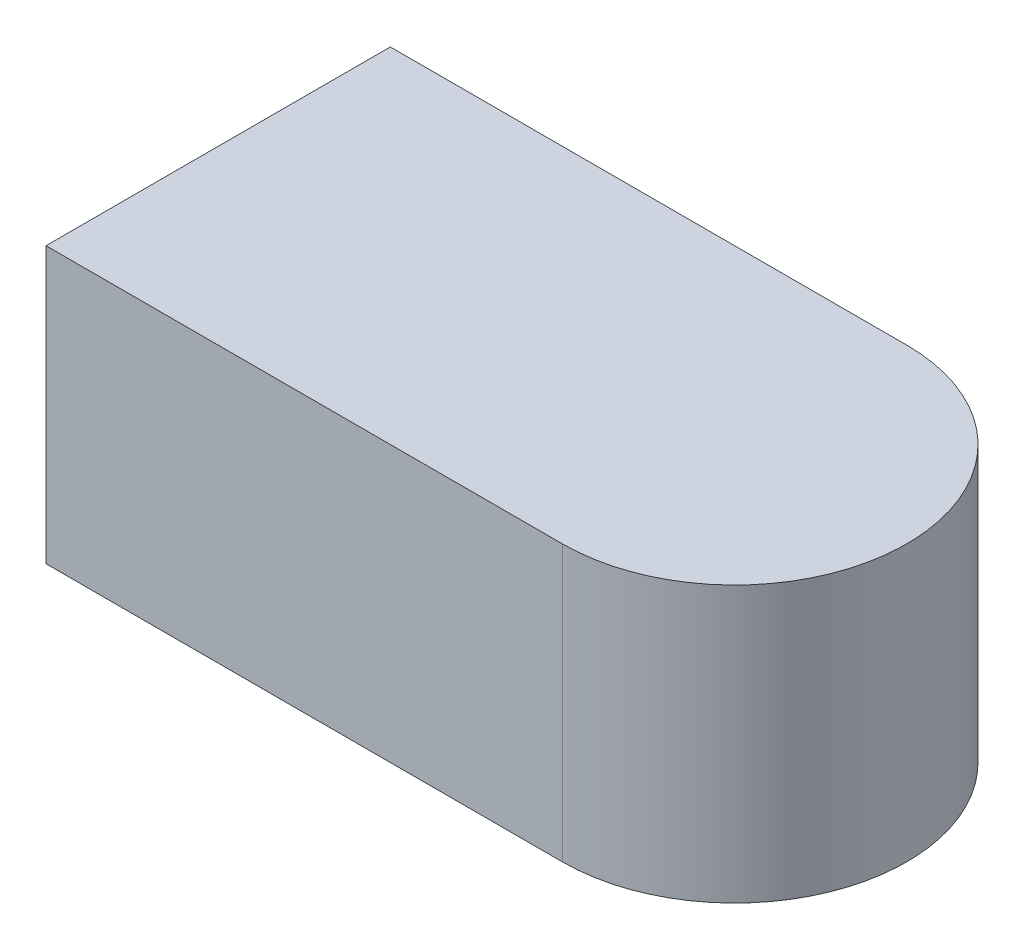
ISO-10303-21;
HEADER;
FILE_DESCRIPTION(('STEP AP214'),'2;1');
FILE_NAME('part.step','',(''),(''),'','','');
FILE_SCHEMA(('AUTOMOTIVE_DESIGN { 1 0 10303 214 1 1 1 1 }'));
ENDSEC;
DATA;
#1=APPLICATION_CONTEXT('core data for automotive mechanical design processes');
#2=APPLICATION_PROTOCOL_DEFINITION('international standard','automotive_design',2000,#1);
#3=PRODUCT_CONTEXT('',#1,'mechanical');
#4=PRODUCT('Part','Part','',(#3));
#5=PRODUCT_RELATED_PRODUCT_CATEGORY('part','',(#4));
#6=PRODUCT_DEFINITION_FORMATION('','',#4);
#7=PRODUCT_DEFINITION_CONTEXT('part definition',#1,'design');
#8=PRODUCT_DEFINITION('design','',#6,#7);
#9=PRODUCT_DEFINITION_SHAPE('','',#8);
#10=(LENGTH_UNIT() NAMED_UNIT(*) SI_UNIT(.MILLI.,.METRE.));
#11=(NAMED_UNIT(*) PLANE_ANGLE_UNIT() SI_UNIT($,.RADIAN.));
#12=(NAMED_UNIT(*) SI_UNIT($,.STERADIAN.) SOLID_ANGLE_UNIT());
#13=UNCERTAINTY_MEASURE_WITH_UNIT(LENGTH_MEASURE(1.E-05),#10,'distance_accuracy_value','');
#14=(GEOMETRIC_REPRESENTATION_CONTEXT(3) GLOBAL_UNCERTAINTY_ASSIGNED_CONTEXT((#13)) GLOBAL_UNIT_ASSIGNED_CONTEXT((#10,
#11,#12)) REPRESENTATION_CONTEXT('',''));
#15=CARTESIAN_POINT('',(0.,0.,0.));
#16=DIRECTION('',(0.,0.,1.));
#17=DIRECTION('',(1.,0.,0.));
#18=AXIS2_PLACEMENT_3D('',#15,#16,#17);
#19=CARTESIAN_POINT('',(0.,0.2,0.));
#20=DIRECTION('',(0.,1.,0.));
#21=DIRECTION('',(0.,0.,1.));
#22=AXIS2_PLACEMENT_3D('',#19,#20,#21);
#23=PLANE('',#22);
#24=DIRECTION('',(-1.,0.,0.));
#25=VECTOR('',#24,1.);
#26=CARTESIAN_POINT('',(-2.125,0.2,-2.625));
#27=LINE('',#26,#25);
#28=CARTESIAN_POINT('',(-2.5,0.2,-2.625));
#29=VERTEX_POINT('',#28);
#30=CARTESIAN_POINT('',(-2.125,0.2,-2.625));
#31=VERTEX_POINT('',#30);
#32=EDGE_CURVE('E45',#29,#31,#27,.F.);
#33=ORIENTED_EDGE('',*,*,#32,.F.);
#34=DIRECTION('',(0.,0.,1.));
#35=VECTOR('',#34,1.);
#36=CARTESIAN_POINT('',(-2.5,0.2,-2.625));
#37=LINE('',#36,#35);
#38=CARTESIAN_POINT('',(-2.5,0.2,-2.375));
#39=VERTEX_POINT('',#38);
#40=EDGE_CURVE('E55',#39,#29,#37,.F.);
#41=ORIENTED_EDGE('',*,*,#40,.F.);
#42=DIRECTION('',(1.,0.,0.));
#43=VECTOR('',#42,1.);
#44=CARTESIAN_POINT('',(-2.5,0.2,-2.375));
#45=LINE('',#44,#43);
#46=CARTESIAN_POINT('',(-2.125,0.2,-2.375));
#47=VERTEX_POINT('',#46);
#48=EDGE_CURVE('E64',#47,#39,#45,.F.);
#49=ORIENTED_EDGE('',*,*,#48,.F.);
#50=CARTESIAN_POINT('',(-2.125,0.2,-2.5));
#51=DIRECTION('',(0.,1.,0.));
#52=DIRECTION('',(0.,0.,1.));
#53=AXIS2_PLACEMENT_3D('',#50,#51,#52);
#54=CIRCLE('',#53,0.125);
#55=EDGE_CURVE('E20',#31,#47,#54,.F.);
#56=ORIENTED_EDGE('',*,*,#55,.F.);
#57=EDGE_LOOP('',(#33,#41,#49,#56));
#58=FACE_BOUND('',#57,.T.);
#59=ADVANCED_FACE('F17',(#58),#23,.T.);
#60=CARTESIAN_POINT('',(-2.5,0.,-2.625));
#61=DIRECTION('',(-1.,0.,0.));
#62=DIRECTION('',(0.,0.,1.));
#63=AXIS2_PLACEMENT_3D('',#60,#61,#62);
#64=PLANE('',#63);
#65=DIRECTION('',(0.,1.,0.));
#66=VECTOR('',#65,1.);
#67=CARTESIAN_POINT('',(-2.5,0.,-2.625));
#68=LINE('',#67,#66);
#69=CARTESIAN_POINT('',(-2.5,0.,-2.625));
#70=VERTEX_POINT('',#69);
#71=EDGE_CURVE('E83',#70,#29,#68,.T.);
#72=ORIENTED_EDGE('',*,*,#71,.F.);
#73=DIRECTION('',(0.,0.,1.));
#74=VECTOR('',#73,1.);
#75=CARTESIAN_POINT('',(-2.5,0.,0.));
#76=LINE('',#75,#74);
#77=CARTESIAN_POINT('',(-2.5,0.,-2.375));
#78=VERTEX_POINT('',#77);
#79=EDGE_CURVE('E75',#70,#78,#76,.T.);
#80=ORIENTED_EDGE('',*,*,#79,.T.);
#81=DIRECTION('',(0.,1.,0.));
#82=VECTOR('',#81,1.);
#83=CARTESIAN_POINT('',(-2.5,0.,-2.375));
#84=LINE('',#83,#82);
#85=EDGE_CURVE('E67',#39,#78,#84,.F.);
#86=ORIENTED_EDGE('',*,*,#85,.F.);
#87=ORIENTED_EDGE('',*,*,#40,.T.);
#88=EDGE_LOOP('',(#72,#80,#86,#87));
#89=FACE_BOUND('',#88,.T.);
#90=ADVANCED_FACE('F74',(#89),#64,.T.);
#91=CARTESIAN_POINT('',(-2.5,0.,-2.375));
#92=DIRECTION('',(0.,0.,1.));
#93=DIRECTION('',(1.,0.,0.));
#94=AXIS2_PLACEMENT_3D('',#91,#92,#93);
#95=PLANE('',#94);
#96=ORIENTED_EDGE('',*,*,#85,.T.);
#97=DIRECTION('',(1.,0.,0.));
#98=VECTOR('',#97,1.);
#99=CARTESIAN_POINT('',(0.,0.,-2.375));
#100=LINE('',#99,#98);
#101=CARTESIAN_POINT('',(-2.125,0.,-2.375));
#102=VERTEX_POINT('',#101);
#103=EDGE_CURVE('E90',#78,#102,#100,.T.);
#104=ORIENTED_EDGE('',*,*,#103,.T.);
#105=DIRECTION('',(0.,1.,0.));
#106=VECTOR('',#105,1.);
#107=CARTESIAN_POINT('',(-2.125,0.,-2.375));
#108=LINE('',#107,#106);
#109=EDGE_CURVE('E69',#47,#102,#108,.F.);
#110=ORIENTED_EDGE('',*,*,#109,.F.);
#111=ORIENTED_EDGE('',*,*,#48,.T.);
#112=EDGE_LOOP('',(#96,#104,#110,#111));
#113=FACE_BOUND('',#112,.T.);
#114=ADVANCED_FACE('F65',(#113),#95,.T.);
#115=CARTESIAN_POINT('',(-2.125,0.,-2.5));
#116=DIRECTION('',(0.,1.,0.));
#117=DIRECTION('',(0.,0.,1.));
#118=AXIS2_PLACEMENT_3D('',#115,#116,#117);
#119=CYLINDRICAL_SURFACE('',#118,0.125);
#120=ORIENTED_EDGE('',*,*,#109,.T.);
#121=CARTESIAN_POINT('',(-2.125,0.,-2.5));
#122=DIRECTION('',(0.,1.,0.));
#123=DIRECTION('',(0.,0.,1.));
#124=AXIS2_PLACEMENT_3D('',#121,#122,#123);
#125=CIRCLE('',#124,0.125);
#126=CARTESIAN_POINT('',(-2.125,0.,-2.625));
#127=VERTEX_POINT('',#126);
#128=EDGE_CURVE('E26',#102,#127,#125,.T.);
#129=ORIENTED_EDGE('',*,*,#128,.T.);
#130=DIRECTION('',(0.,1.,0.));
#131=VECTOR('',#130,1.);
#132=CARTESIAN_POINT('',(-2.125,0.,-2.625));
#133=LINE('',#132,#131);
#134=EDGE_CURVE('E34',#31,#127,#133,.F.);
#135=ORIENTED_EDGE('',*,*,#134,.F.);
#136=ORIENTED_EDGE('',*,*,#55,.T.);
#137=EDGE_LOOP('',(#120,#129,#135,#136));
#138=FACE_BOUND('',#137,.T.);
#139=ADVANCED_FACE('F104',(#138),#119,.T.);
#140=CARTESIAN_POINT('',(-2.125,0.,-2.625));
#141=DIRECTION('',(0.,0.,-1.));
#142=DIRECTION('',(-1.,0.,0.));
#143=AXIS2_PLACEMENT_3D('',#140,#141,#142);
#144=PLANE('',#143);
#145=ORIENTED_EDGE('',*,*,#134,.T.);
#146=DIRECTION('',(1.,0.,0.));
#147=VECTOR('',#146,1.);
#148=CARTESIAN_POINT('',(0.,0.,-2.625));
#149=LINE('',#148,#147);
#150=EDGE_CURVE('E11',#127,#70,#149,.F.);
#151=ORIENTED_EDGE('',*,*,#150,.T.);
#152=ORIENTED_EDGE('',*,*,#71,.T.);
#153=ORIENTED_EDGE('',*,*,#32,.T.);
#154=EDGE_LOOP('',(#145,#151,#152,#153));
#155=FACE_BOUND('',#154,.T.);
#156=ADVANCED_FACE('F107',(#155),#144,.T.);
#157=CARTESIAN_POINT('',(0.,0.,0.));
#158=DIRECTION('',(0.,1.,0.));
#159=DIRECTION('',(0.,0.,1.));
#160=AXIS2_PLACEMENT_3D('',#157,#158,#159);
#161=PLANE('',#160);
#162=ORIENTED_EDGE('',*,*,#128,.F.);
#163=ORIENTED_EDGE('',*,*,#103,.F.);
#164=ORIENTED_EDGE('',*,*,#79,.F.);
#165=ORIENTED_EDGE('',*,*,#150,.F.);
#166=EDGE_LOOP('',(#162,#163,#164,#165));
#167=FACE_BOUND('',#166,.T.);
#168=ADVANCED_FACE('F106',(#167),#161,.F.);
#169=CLOSED_SHELL('',(#59,#90,#114,#139,#156,#168));
#170=MANIFOLD_SOLID_BREP('B1',#169);
#171=ADVANCED_BREP_SHAPE_REPRESENTATION('',(#18,#170),#14);
#172=SHAPE_DEFINITION_REPRESENTATION(#9,#171);
ENDSEC;
END-ISO-10303-21;
